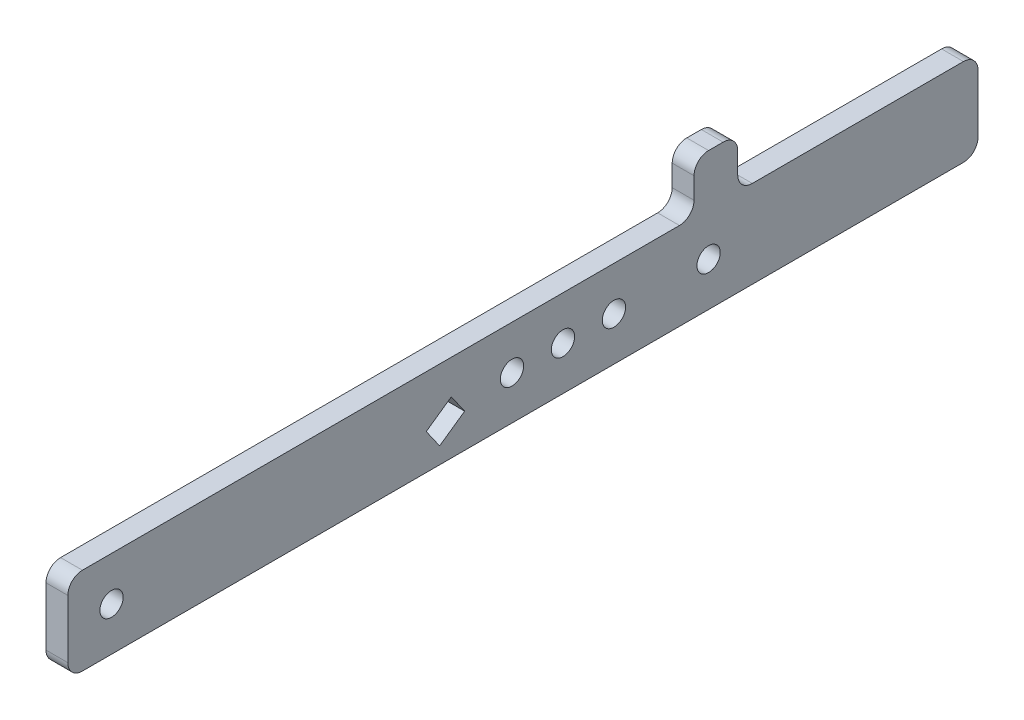
ISO-10303-21;
HEADER;
FILE_DESCRIPTION(('STEP AP214'),'2;1');
FILE_NAME('part.step','',(''),(''),'','','');
FILE_SCHEMA(('AUTOMOTIVE_DESIGN { 1 0 10303 214 1 1 1 1 }'));
ENDSEC;
DATA;
#1=APPLICATION_CONTEXT('core data for automotive mechanical design processes');
#2=APPLICATION_PROTOCOL_DEFINITION('international standard','automotive_design',2000,#1);
#3=PRODUCT_CONTEXT('',#1,'mechanical');
#4=PRODUCT('Part','Part','',(#3));
#5=PRODUCT_RELATED_PRODUCT_CATEGORY('part','',(#4));
#6=PRODUCT_DEFINITION_FORMATION('','',#4);
#7=PRODUCT_DEFINITION_CONTEXT('part definition',#1,'design');
#8=PRODUCT_DEFINITION('design','',#6,#7);
#9=PRODUCT_DEFINITION_SHAPE('','',#8);
#10=(LENGTH_UNIT() NAMED_UNIT(*) SI_UNIT(.MILLI.,.METRE.));
#11=(NAMED_UNIT(*) PLANE_ANGLE_UNIT() SI_UNIT($,.RADIAN.));
#12=(NAMED_UNIT(*) SI_UNIT($,.STERADIAN.) SOLID_ANGLE_UNIT());
#13=UNCERTAINTY_MEASURE_WITH_UNIT(LENGTH_MEASURE(1.E-05),#10,'distance_accuracy_value','');
#14=(GEOMETRIC_REPRESENTATION_CONTEXT(3) GLOBAL_UNCERTAINTY_ASSIGNED_CONTEXT((#13)) GLOBAL_UNIT_ASSIGNED_CONTEXT((#10,
#11,#12)) REPRESENTATION_CONTEXT('',''));
#15=CARTESIAN_POINT('',(0.,0.,0.));
#16=DIRECTION('',(0.,0.,1.));
#17=DIRECTION('',(1.,0.,0.));
#18=AXIS2_PLACEMENT_3D('',#15,#16,#17);
#19=CARTESIAN_POINT('',(-40.,30.0000000000005,-450.));
#20=DIRECTION('',(0.,-1.,0.));
#21=DIRECTION('',(0.,0.,-1.));
#22=AXIS2_PLACEMENT_3D('',#19,#20,#21);
#23=PLANE('',#22);
#24=DIRECTION('',(0.,0.,1.));
#25=VECTOR('',#24,1.);
#26=CARTESIAN_POINT('',(-40.,30.0000000000005,-450.));
#27=LINE('',#26,#25);
#28=CARTESIAN_POINT('',(-40.,30.0000000000005,-245.));
#29=VERTEX_POINT('',#28);
#30=CARTESIAN_POINT('',(-40.,30.0000000000005,165.));
#31=VERTEX_POINT('',#30);
#32=EDGE_CURVE('E260',#29,#31,#27,.T.);
#33=ORIENTED_EDGE('',*,*,#32,.F.);
#34=DIRECTION('',(-1.,0.,0.));
#35=VECTOR('',#34,1.);
#36=CARTESIAN_POINT('',(-40.,30.0000000000005,-245.));
#37=LINE('',#36,#35);
#38=CARTESIAN_POINT('',(-55.,30.0000000000005,-245.));
#39=VERTEX_POINT('',#38);
#40=EDGE_CURVE('E337',#29,#39,#37,.T.);
#41=ORIENTED_EDGE('',*,*,#40,.T.);
#42=DIRECTION('',(0.,0.,1.));
#43=VECTOR('',#42,1.);
#44=CARTESIAN_POINT('',(-55.,30.0000000000005,-450.));
#45=LINE('',#44,#43);
#46=CARTESIAN_POINT('',(-55.,30.0000000000005,165.));
#47=VERTEX_POINT('',#46);
#48=EDGE_CURVE('E265',#39,#47,#45,.T.);
#49=ORIENTED_EDGE('',*,*,#48,.T.);
#50=DIRECTION('',(1.,0.,0.));
#51=VECTOR('',#50,1.);
#52=CARTESIAN_POINT('',(-40.,30.0000000000005,165.));
#53=LINE('',#52,#51);
#54=EDGE_CURVE('E312',#47,#31,#53,.T.);
#55=ORIENTED_EDGE('',*,*,#54,.T.);
#56=EDGE_LOOP('',(#33,#41,#49,#55));
#57=FACE_BOUND('',#56,.T.);
#58=ADVANCED_FACE('F41',(#57),#23,.F.);
#59=CARTESIAN_POINT('',(-55.,0.,-200.));
#60=DIRECTION('',(-1.,0.,0.));
#61=DIRECTION('',(0.,0.,1.));
#62=AXIS2_PLACEMENT_3D('',#59,#60,#61);
#63=CYLINDRICAL_SURFACE('',#62,8.);
#64=CARTESIAN_POINT('',(-39.9999999999997,0.,-200.));
#65=DIRECTION('',(-1.,0.,0.));
#66=DIRECTION('',(0.,0.,1.));
#67=AXIS2_PLACEMENT_3D('',#64,#65,#66);
#68=CIRCLE('',#67,8.);
#69=CARTESIAN_POINT('',(-39.9999999999997,0.,-192.));
#70=VERTEX_POINT('',#69);
#71=EDGE_CURVE('E274',#70,#70,#68,.T.);
#72=ORIENTED_EDGE('',*,*,#71,.F.);
#73=EDGE_LOOP('',(#72));
#74=FACE_BOUND('',#73,.T.);
#75=CARTESIAN_POINT('',(-55.,0.,-200.));
#76=DIRECTION('',(-1.,0.,0.));
#77=DIRECTION('',(0.,0.,1.));
#78=AXIS2_PLACEMENT_3D('',#75,#76,#77);
#79=CIRCLE('',#78,8.);
#80=CARTESIAN_POINT('',(-55.,0.,-192.));
#81=VERTEX_POINT('',#80);
#82=EDGE_CURVE('E277',#81,#81,#79,.T.);
#83=ORIENTED_EDGE('',*,*,#82,.T.);
#84=EDGE_LOOP('',(#83));
#85=FACE_BOUND('',#84,.T.);
#86=ADVANCED_FACE('F472',(#74,#85),#63,.F.);
#87=CARTESIAN_POINT('',(-55.,-30.0000000000005,-450.));
#88=DIRECTION('',(0.,1.,0.));
#89=DIRECTION('',(0.,0.,1.));
#90=AXIS2_PLACEMENT_3D('',#87,#88,#89);
#91=PLANE('',#90);
#92=DIRECTION('',(0.,0.,1.));
#93=VECTOR('',#92,1.);
#94=CARTESIAN_POINT('',(-40.,-30.0000000000005,-450.));
#95=LINE('',#94,#93);
#96=CARTESIAN_POINT('',(-40.,-30.0000000000005,-440.));
#97=VERTEX_POINT('',#96);
#98=CARTESIAN_POINT('',(-40.,-30.0000000000005,165.));
#99=VERTEX_POINT('',#98);
#100=EDGE_CURVE('E250',#97,#99,#95,.T.);
#101=ORIENTED_EDGE('',*,*,#100,.T.);
#102=DIRECTION('',(-1.,0.,0.));
#103=VECTOR('',#102,1.);
#104=CARTESIAN_POINT('',(-55.,-30.0000000000005,165.));
#105=LINE('',#104,#103);
#106=CARTESIAN_POINT('',(-55.,-30.0000000000005,165.));
#107=VERTEX_POINT('',#106);
#108=EDGE_CURVE('E282',#99,#107,#105,.T.);
#109=ORIENTED_EDGE('',*,*,#108,.T.);
#110=DIRECTION('',(0.,0.,1.));
#111=VECTOR('',#110,1.);
#112=CARTESIAN_POINT('',(-55.,-30.0000000000005,-450.));
#113=LINE('',#112,#111);
#114=CARTESIAN_POINT('',(-55.,-30.0000000000005,-440.));
#115=VERTEX_POINT('',#114);
#116=EDGE_CURVE('E270',#115,#107,#113,.T.);
#117=ORIENTED_EDGE('',*,*,#116,.F.);
#118=DIRECTION('',(-1.,0.,0.));
#119=VECTOR('',#118,1.);
#120=CARTESIAN_POINT('',(-55.,-30.0000000000005,-440.));
#121=LINE('',#120,#119);
#122=EDGE_CURVE('E280',#115,#97,#121,.F.);
#123=ORIENTED_EDGE('',*,*,#122,.T.);
#124=EDGE_LOOP('',(#101,#109,#117,#123));
#125=FACE_BOUND('',#124,.T.);
#126=ADVANCED_FACE('F393',(#125),#91,.F.);
#127=CARTESIAN_POINT('',(-55.,-30.0000000000005,-450.));
#128=DIRECTION('',(1.,0.,0.));
#129=DIRECTION('',(0.,0.,-1.));
#130=AXIS2_PLACEMENT_3D('',#127,#128,#129);
#131=PLANE('',#130);
#132=DIRECTION('',(0.,0.573576436351056,-0.819152044288984));
#133=VECTOR('',#132,1.);
#134=CARTESIAN_POINT('',(-55.,-5.61297655954159,-71.1121153167902));
#135=LINE('',#134,#133);
#136=CARTESIAN_POINT('',(-55.,-5.61297655954154,-71.1121153167902));
#137=VERTEX_POINT('',#136);
#138=CARTESIAN_POINT('',(-55.,6.43212860383058,-88.3143082468588));
#139=VERTEX_POINT('',#138);
#140=EDGE_CURVE('E194',#137,#139,#135,.T.);
#141=ORIENTED_EDGE('',*,*,#140,.F.);
#142=DIRECTION('',(0.,0.819152044288984,0.573576436351057));
#143=VECTOR('',#142,1.);
#144=CARTESIAN_POINT('',(-55.,-5.61297655954159,-71.1121153167902));
#145=LINE('',#144,#143);
#146=CARTESIAN_POINT('',(-55.,-18.7194092681653,-80.2893382984071));
#147=VERTEX_POINT('',#146);
#148=EDGE_CURVE('E199',#147,#137,#145,.T.);
#149=ORIENTED_EDGE('',*,*,#148,.F.);
#150=DIRECTION('',(0.,-0.573576436351057,0.819152044288984));
#151=VECTOR('',#150,1.);
#152=CARTESIAN_POINT('',(-55.,-18.7194092681653,-80.2893382984071));
#153=LINE('',#152,#151);
#154=CARTESIAN_POINT('',(-55.,-6.67430410479316,-97.4915312284757));
#155=VERTEX_POINT('',#154);
#156=EDGE_CURVE('E204',#155,#147,#153,.T.);
#157=ORIENTED_EDGE('',*,*,#156,.F.);
#158=DIRECTION('',(0.,-0.819152044288984,-0.573576436351057));
#159=VECTOR('',#158,1.);
#160=CARTESIAN_POINT('',(-55.,6.43212860383058,-88.3143082468588));
#161=LINE('',#160,#159);
#162=EDGE_CURVE('E183',#139,#155,#161,.T.);
#163=ORIENTED_EDGE('',*,*,#162,.F.);
#164=EDGE_LOOP('',(#141,#149,#157,#163));
#165=FACE_BOUND('',#164,.T.);
#166=CARTESIAN_POINT('',(-55.,0.,-165.));
#167=DIRECTION('',(-1.,0.,0.));
#168=DIRECTION('',(0.,0.,1.));
#169=AXIS2_PLACEMENT_3D('',#166,#167,#168);
#170=CIRCLE('',#169,8.);
#171=CARTESIAN_POINT('',(-55.,0.,-157.));
#172=VERTEX_POINT('',#171);
#173=EDGE_CURVE('E219',#172,#172,#170,.T.);
#174=ORIENTED_EDGE('',*,*,#173,.F.);
#175=EDGE_LOOP('',(#174));
#176=FACE_BOUND('',#175,.T.);
#177=CARTESIAN_POINT('',(-55.,0.,-265.));
#178=DIRECTION('',(-1.,0.,0.));
#179=DIRECTION('',(0.,0.,1.));
#180=AXIS2_PLACEMENT_3D('',#177,#178,#179);
#181=CIRCLE('',#180,8.);
#182=CARTESIAN_POINT('',(-55.,0.,-257.));
#183=VERTEX_POINT('',#182);
#184=EDGE_CURVE('E222',#183,#183,#181,.T.);
#185=ORIENTED_EDGE('',*,*,#184,.F.);
#186=EDGE_LOOP('',(#185));
#187=FACE_BOUND('',#186,.T.);
#188=CARTESIAN_POINT('',(-55.,0.,-130.));
#189=DIRECTION('',(-1.,0.,0.));
#190=DIRECTION('',(0.,0.,1.));
#191=AXIS2_PLACEMENT_3D('',#188,#189,#190);
#192=CIRCLE('',#191,8.);
#193=CARTESIAN_POINT('',(-55.,0.,-122.));
#194=VERTEX_POINT('',#193);
#195=EDGE_CURVE('E228',#194,#194,#192,.T.);
#196=ORIENTED_EDGE('',*,*,#195,.F.);
#197=EDGE_LOOP('',(#196));
#198=FACE_BOUND('',#197,.T.);
#199=CARTESIAN_POINT('',(-55.,0.,145.));
#200=DIRECTION('',(-1.,0.,0.));
#201=DIRECTION('',(0.,0.,1.));
#202=AXIS2_PLACEMENT_3D('',#199,#200,#201);
#203=CIRCLE('',#202,8.);
#204=CARTESIAN_POINT('',(-55.,0.,153.));
#205=VERTEX_POINT('',#204);
#206=EDGE_CURVE('E234',#205,#205,#203,.T.);
#207=ORIENTED_EDGE('',*,*,#206,.F.);
#208=EDGE_LOOP('',(#207));
#209=FACE_BOUND('',#208,.T.);
#210=DIRECTION('',(0.,0.,-1.));
#211=VECTOR('',#210,1.);
#212=CARTESIAN_POINT('',(-55.,64.5771722552891,-255.));
#213=LINE('',#212,#211);
#214=CARTESIAN_POINT('',(-55.,64.5771722552891,-265.));
#215=VERTEX_POINT('',#214);
#216=CARTESIAN_POINT('',(-55.,64.5771722552891,-275.));
#217=VERTEX_POINT('',#216);
#218=EDGE_CURVE('E357',#215,#217,#213,.T.);
#219=ORIENTED_EDGE('',*,*,#218,.T.);
#220=CARTESIAN_POINT('',(-55.,54.5771722552891,-275.));
#221=DIRECTION('',(1.,0.,0.));
#222=DIRECTION('',(0.,0.,-1.));
#223=AXIS2_PLACEMENT_3D('',#220,#221,#222);
#224=CIRCLE('',#223,10.);
#225=CARTESIAN_POINT('',(-55.,54.5771722552891,-285.));
#226=VERTEX_POINT('',#225);
#227=EDGE_CURVE('E331',#217,#226,#224,.F.);
#228=ORIENTED_EDGE('',*,*,#227,.T.);
#229=DIRECTION('',(0.,-1.,0.));
#230=VECTOR('',#229,1.);
#231=CARTESIAN_POINT('',(-55.,30.0000000000005,-285.));
#232=LINE('',#231,#230);
#233=CARTESIAN_POINT('',(-55.,40.0000000000005,-285.));
#234=VERTEX_POINT('',#233);
#235=EDGE_CURVE('E427',#226,#234,#232,.T.);
#236=ORIENTED_EDGE('',*,*,#235,.T.);
#237=CARTESIAN_POINT('',(-55.,40.0000000000005,-295.));
#238=DIRECTION('',(1.,0.,0.));
#239=DIRECTION('',(0.,0.,-1.));
#240=AXIS2_PLACEMENT_3D('',#237,#238,#239);
#241=CIRCLE('',#240,10.);
#242=CARTESIAN_POINT('',(-55.,30.0000000000005,-295.));
#243=VERTEX_POINT('',#242);
#244=EDGE_CURVE('E344',#234,#243,#241,.T.);
#245=ORIENTED_EDGE('',*,*,#244,.T.);
#246=CARTESIAN_POINT('',(-55.,30.0000000000005,-440.));
#247=VERTEX_POINT('',#246);
#248=EDGE_CURVE('E266',#247,#243,#45,.T.);
#249=ORIENTED_EDGE('',*,*,#248,.F.);
#250=CARTESIAN_POINT('',(-55.,20.0000000000005,-440.));
#251=DIRECTION('',(1.,0.,0.));
#252=DIRECTION('',(0.,0.,-1.));
#253=AXIS2_PLACEMENT_3D('',#250,#251,#252);
#254=CIRCLE('',#253,10.);
#255=CARTESIAN_POINT('',(-55.,20.0000000000005,-450.));
#256=VERTEX_POINT('',#255);
#257=EDGE_CURVE('E288',#247,#256,#254,.F.);
#258=ORIENTED_EDGE('',*,*,#257,.T.);
#259=DIRECTION('',(0.,1.,0.));
#260=VECTOR('',#259,1.);
#261=CARTESIAN_POINT('',(-55.,-30.0000000000005,-450.));
#262=LINE('',#261,#260);
#263=CARTESIAN_POINT('',(-55.,-20.0000000000005,-450.));
#264=VERTEX_POINT('',#263);
#265=EDGE_CURVE('E241',#264,#256,#262,.T.);
#266=ORIENTED_EDGE('',*,*,#265,.F.);
#267=CARTESIAN_POINT('',(-55.,-20.0000000000005,-440.));
#268=DIRECTION('',(1.,0.,0.));
#269=DIRECTION('',(0.,0.,-1.));
#270=AXIS2_PLACEMENT_3D('',#267,#268,#269);
#271=CIRCLE('',#270,10.);
#272=EDGE_CURVE('E290',#264,#115,#271,.F.);
#273=ORIENTED_EDGE('',*,*,#272,.T.);
#274=ORIENTED_EDGE('',*,*,#116,.T.);
#275=CARTESIAN_POINT('',(-55.,-20.0000000000005,165.));
#276=DIRECTION('',(1.,0.,0.));
#277=DIRECTION('',(0.,0.,-1.));
#278=AXIS2_PLACEMENT_3D('',#275,#276,#277);
#279=CIRCLE('',#278,10.);
#280=CARTESIAN_POINT('',(-55.,-20.0000000000005,175.));
#281=VERTEX_POINT('',#280);
#282=EDGE_CURVE('E292',#107,#281,#279,.F.);
#283=ORIENTED_EDGE('',*,*,#282,.T.);
#284=DIRECTION('',(0.,1.,0.));
#285=VECTOR('',#284,1.);
#286=CARTESIAN_POINT('',(-55.,-30.0000000000005,175.));
#287=LINE('',#286,#285);
#288=CARTESIAN_POINT('',(-55.,20.0000000000005,175.));
#289=VERTEX_POINT('',#288);
#290=EDGE_CURVE('E240',#281,#289,#287,.T.);
#291=ORIENTED_EDGE('',*,*,#290,.T.);
#292=CARTESIAN_POINT('',(-55.,20.0000000000005,165.));
#293=DIRECTION('',(1.,0.,0.));
#294=DIRECTION('',(0.,0.,-1.));
#295=AXIS2_PLACEMENT_3D('',#292,#293,#294);
#296=CIRCLE('',#295,10.);
#297=EDGE_CURVE('E285',#289,#47,#296,.F.);
#298=ORIENTED_EDGE('',*,*,#297,.T.);
#299=ORIENTED_EDGE('',*,*,#48,.F.);
#300=CARTESIAN_POINT('',(-55.,40.0000000000005,-245.));
#301=DIRECTION('',(1.,0.,0.));
#302=DIRECTION('',(0.,0.,-1.));
#303=AXIS2_PLACEMENT_3D('',#300,#301,#302);
#304=CIRCLE('',#303,10.);
#305=CARTESIAN_POINT('',(-55.,40.0000000000005,-255.));
#306=VERTEX_POINT('',#305);
#307=EDGE_CURVE('E49',#39,#306,#304,.T.);
#308=ORIENTED_EDGE('',*,*,#307,.T.);
#309=DIRECTION('',(0.,1.,0.));
#310=VECTOR('',#309,1.);
#311=CARTESIAN_POINT('',(-55.,30.0000000000005,-255.));
#312=LINE('',#311,#310);
#313=CARTESIAN_POINT('',(-55.,54.5771722552891,-255.));
#314=VERTEX_POINT('',#313);
#315=EDGE_CURVE('E352',#306,#314,#312,.T.);
#316=ORIENTED_EDGE('',*,*,#315,.T.);
#317=CARTESIAN_POINT('',(-55.,54.5771722552891,-265.));
#318=DIRECTION('',(1.,0.,0.));
#319=DIRECTION('',(0.,0.,-1.));
#320=AXIS2_PLACEMENT_3D('',#317,#318,#319);
#321=CIRCLE('',#320,10.);
#322=EDGE_CURVE('E329',#314,#215,#321,.F.);
#323=ORIENTED_EDGE('',*,*,#322,.T.);
#324=EDGE_LOOP('',(#219,#228,#236,#245,#249,#258,#266,#273,#274,#283,#291,#298,#299,#308,#316,#323));
#325=FACE_BOUND('',#324,.T.);
#326=ORIENTED_EDGE('',*,*,#82,.F.);
#327=EDGE_LOOP('',(#326));
#328=FACE_BOUND('',#327,.T.);
#329=ADVANCED_FACE('F201',(#165,#176,#187,#198,#209,#325,#328),#131,.F.);
#330=ORIENTED_EDGE('',*,*,#248,.T.);
#331=DIRECTION('',(-1.,0.,0.));
#332=VECTOR('',#331,1.);
#333=CARTESIAN_POINT('',(-40.,30.0000000000005,-295.));
#334=LINE('',#333,#332);
#335=CARTESIAN_POINT('',(-40.,30.0000000000005,-295.));
#336=VERTEX_POINT('',#335);
#337=EDGE_CURVE('E322',#243,#336,#334,.F.);
#338=ORIENTED_EDGE('',*,*,#337,.T.);
#339=CARTESIAN_POINT('',(-40.,30.0000000000005,-440.));
#340=VERTEX_POINT('',#339);
#341=EDGE_CURVE('E261',#340,#336,#27,.T.);
#342=ORIENTED_EDGE('',*,*,#341,.F.);
#343=DIRECTION('',(1.,0.,0.));
#344=VECTOR('',#343,1.);
#345=CARTESIAN_POINT('',(-40.,30.0000000000005,-440.));
#346=LINE('',#345,#344);
#347=EDGE_CURVE('E315',#340,#247,#346,.F.);
#348=ORIENTED_EDGE('',*,*,#347,.T.);
#349=EDGE_LOOP('',(#330,#338,#342,#348));
#350=FACE_BOUND('',#349,.T.);
#351=ADVANCED_FACE('F413',(#350),#23,.F.);
#352=CARTESIAN_POINT('',(-40.,-30.0000000000005,-450.));
#353=DIRECTION('',(-1.,0.,0.));
#354=DIRECTION('',(0.,0.,1.));
#355=AXIS2_PLACEMENT_3D('',#352,#353,#354);
#356=PLANE('',#355);
#357=DIRECTION('',(0.,0.573576436351057,-0.819152044288984));
#358=VECTOR('',#357,1.);
#359=CARTESIAN_POINT('',(-40.,-18.7194092681653,-80.2893382984071));
#360=LINE('',#359,#358);
#361=CARTESIAN_POINT('',(-40.,-18.7194092681653,-80.2893382984071));
#362=VERTEX_POINT('',#361);
#363=CARTESIAN_POINT('',(-40.,-6.67430410479316,-97.4915312284757));
#364=VERTEX_POINT('',#363);
#365=EDGE_CURVE('E437',#362,#364,#360,.T.);
#366=ORIENTED_EDGE('',*,*,#365,.F.);
#367=DIRECTION('',(0.,-0.819152044288984,-0.573576436351057));
#368=VECTOR('',#367,1.);
#369=CARTESIAN_POINT('',(-40.,-5.61297655954159,-71.1121153167902));
#370=LINE('',#369,#368);
#371=CARTESIAN_POINT('',(-40.,-5.61297655954159,-71.1121153167902));
#372=VERTEX_POINT('',#371);
#373=EDGE_CURVE('E216',#372,#362,#370,.T.);
#374=ORIENTED_EDGE('',*,*,#373,.F.);
#375=DIRECTION('',(0.,-0.573576436351057,0.819152044288984));
#376=VECTOR('',#375,1.);
#377=CARTESIAN_POINT('',(-40.,-5.61297655954159,-71.1121153167902));
#378=LINE('',#377,#376);
#379=CARTESIAN_POINT('',(-40.,6.43212860383061,-88.3143082468588));
#380=VERTEX_POINT('',#379);
#381=EDGE_CURVE('E213',#380,#372,#378,.T.);
#382=ORIENTED_EDGE('',*,*,#381,.F.);
#383=DIRECTION('',(0.,0.819152044288984,0.573576436351057));
#384=VECTOR('',#383,1.);
#385=CARTESIAN_POINT('',(-40.,6.43212860383058,-88.3143082468588));
#386=LINE('',#385,#384);
#387=EDGE_CURVE('E186',#364,#380,#386,.T.);
#388=ORIENTED_EDGE('',*,*,#387,.F.);
#389=EDGE_LOOP('',(#366,#374,#382,#388));
#390=FACE_BOUND('',#389,.T.);
#391=CARTESIAN_POINT('',(-39.9999999999997,0.,-165.));
#392=DIRECTION('',(-1.,0.,0.));
#393=DIRECTION('',(0.,0.,1.));
#394=AXIS2_PLACEMENT_3D('',#391,#392,#393);
#395=CIRCLE('',#394,8.);
#396=CARTESIAN_POINT('',(-39.9999999999997,0.,-157.));
#397=VERTEX_POINT('',#396);
#398=EDGE_CURVE('E215',#397,#397,#395,.T.);
#399=ORIENTED_EDGE('',*,*,#398,.T.);
#400=EDGE_LOOP('',(#399));
#401=FACE_BOUND('',#400,.T.);
#402=CARTESIAN_POINT('',(-39.9999999999995,0.,-265.));
#403=DIRECTION('',(-1.,0.,0.));
#404=DIRECTION('',(0.,0.,1.));
#405=AXIS2_PLACEMENT_3D('',#402,#403,#404);
#406=CIRCLE('',#405,8.);
#407=CARTESIAN_POINT('',(-39.9999999999995,0.,-257.));
#408=VERTEX_POINT('',#407);
#409=EDGE_CURVE('E225',#408,#408,#406,.T.);
#410=ORIENTED_EDGE('',*,*,#409,.T.);
#411=EDGE_LOOP('',(#410));
#412=FACE_BOUND('',#411,.T.);
#413=CARTESIAN_POINT('',(-39.9999999999997,0.,-130.));
#414=DIRECTION('',(-1.,0.,0.));
#415=DIRECTION('',(0.,0.,1.));
#416=AXIS2_PLACEMENT_3D('',#413,#414,#415);
#417=CIRCLE('',#416,8.);
#418=CARTESIAN_POINT('',(-39.9999999999997,0.,-122.));
#419=VERTEX_POINT('',#418);
#420=EDGE_CURVE('E231',#419,#419,#417,.T.);
#421=ORIENTED_EDGE('',*,*,#420,.T.);
#422=EDGE_LOOP('',(#421));
#423=FACE_BOUND('',#422,.T.);
#424=CARTESIAN_POINT('',(-39.9999999999998,0.,145.));
#425=DIRECTION('',(-1.,0.,0.));
#426=DIRECTION('',(0.,0.,1.));
#427=AXIS2_PLACEMENT_3D('',#424,#425,#426);
#428=CIRCLE('',#427,8.);
#429=CARTESIAN_POINT('',(-39.9999999999998,0.,153.));
#430=VERTEX_POINT('',#429);
#431=EDGE_CURVE('E237',#430,#430,#428,.T.);
#432=ORIENTED_EDGE('',*,*,#431,.T.);
#433=EDGE_LOOP('',(#432));
#434=FACE_BOUND('',#433,.T.);
#435=DIRECTION('',(0.,1.,0.));
#436=VECTOR('',#435,1.);
#437=CARTESIAN_POINT('',(-40.,30.0000000000005,-285.));
#438=LINE('',#437,#436);
#439=CARTESIAN_POINT('',(-40.,40.0000000000005,-285.));
#440=VERTEX_POINT('',#439);
#441=CARTESIAN_POINT('',(-40.,54.5771722552891,-285.));
#442=VERTEX_POINT('',#441);
#443=EDGE_CURVE('E419',#440,#442,#438,.T.);
#444=ORIENTED_EDGE('',*,*,#443,.T.);
#445=CARTESIAN_POINT('',(-40.,54.5771722552891,-275.));
#446=DIRECTION('',(-1.,0.,0.));
#447=DIRECTION('',(0.,0.,1.));
#448=AXIS2_PLACEMENT_3D('',#445,#446,#447);
#449=CIRCLE('',#448,10.);
#450=CARTESIAN_POINT('',(-40.,64.5771722552891,-275.));
#451=VERTEX_POINT('',#450);
#452=EDGE_CURVE('E335',#442,#451,#449,.F.);
#453=ORIENTED_EDGE('',*,*,#452,.T.);
#454=DIRECTION('',(0.,0.,1.));
#455=VECTOR('',#454,1.);
#456=CARTESIAN_POINT('',(-40.,64.5771722552891,-255.));
#457=LINE('',#456,#455);
#458=CARTESIAN_POINT('',(-40.,64.5771722552891,-265.));
#459=VERTEX_POINT('',#458);
#460=EDGE_CURVE('E429',#451,#459,#457,.T.);
#461=ORIENTED_EDGE('',*,*,#460,.T.);
#462=CARTESIAN_POINT('',(-40.,54.5771722552891,-265.));
#463=DIRECTION('',(-1.,0.,0.));
#464=DIRECTION('',(0.,0.,1.));
#465=AXIS2_PLACEMENT_3D('',#462,#463,#464);
#466=CIRCLE('',#465,10.);
#467=CARTESIAN_POINT('',(-40.,54.5771722552891,-255.));
#468=VERTEX_POINT('',#467);
#469=EDGE_CURVE('E333',#459,#468,#466,.F.);
#470=ORIENTED_EDGE('',*,*,#469,.T.);
#471=DIRECTION('',(0.,-1.,0.));
#472=VECTOR('',#471,1.);
#473=CARTESIAN_POINT('',(-40.,30.0000000000005,-255.));
#474=LINE('',#473,#472);
#475=CARTESIAN_POINT('',(-40.,40.0000000000005,-255.));
#476=VERTEX_POINT('',#475);
#477=EDGE_CURVE('E426',#468,#476,#474,.T.);
#478=ORIENTED_EDGE('',*,*,#477,.T.);
#479=CARTESIAN_POINT('',(-40.,40.0000000000005,-245.));
#480=DIRECTION('',(-1.,0.,0.));
#481=DIRECTION('',(0.,0.,1.));
#482=AXIS2_PLACEMENT_3D('',#479,#480,#481);
#483=CIRCLE('',#482,10.);
#484=EDGE_CURVE('E11',#476,#29,#483,.T.);
#485=ORIENTED_EDGE('',*,*,#484,.T.);
#486=ORIENTED_EDGE('',*,*,#32,.T.);
#487=CARTESIAN_POINT('',(-40.,20.0000000000005,165.));
#488=DIRECTION('',(-1.,0.,0.));
#489=DIRECTION('',(0.,0.,1.));
#490=AXIS2_PLACEMENT_3D('',#487,#488,#489);
#491=CIRCLE('',#490,10.);
#492=CARTESIAN_POINT('',(-40.,20.0000000000005,175.));
#493=VERTEX_POINT('',#492);
#494=EDGE_CURVE('E298',#31,#493,#491,.F.);
#495=ORIENTED_EDGE('',*,*,#494,.T.);
#496=DIRECTION('',(0.,-1.,0.));
#497=VECTOR('',#496,1.);
#498=CARTESIAN_POINT('',(-40.,-30.0000000000005,175.));
#499=LINE('',#498,#497);
#500=CARTESIAN_POINT('',(-40.,-20.0000000000005,175.));
#501=VERTEX_POINT('',#500);
#502=EDGE_CURVE('E246',#493,#501,#499,.T.);
#503=ORIENTED_EDGE('',*,*,#502,.T.);
#504=CARTESIAN_POINT('',(-40.,-20.0000000000005,165.));
#505=DIRECTION('',(-1.,0.,0.));
#506=DIRECTION('',(0.,0.,1.));
#507=AXIS2_PLACEMENT_3D('',#504,#505,#506);
#508=CIRCLE('',#507,10.);
#509=EDGE_CURVE('E304',#501,#99,#508,.F.);
#510=ORIENTED_EDGE('',*,*,#509,.T.);
#511=ORIENTED_EDGE('',*,*,#100,.F.);
#512=CARTESIAN_POINT('',(-40.,-20.0000000000005,-440.));
#513=DIRECTION('',(-1.,0.,0.));
#514=DIRECTION('',(0.,0.,1.));
#515=AXIS2_PLACEMENT_3D('',#512,#513,#514);
#516=CIRCLE('',#515,10.);
#517=CARTESIAN_POINT('',(-40.,-20.0000000000005,-450.));
#518=VERTEX_POINT('',#517);
#519=EDGE_CURVE('E302',#97,#518,#516,.F.);
#520=ORIENTED_EDGE('',*,*,#519,.T.);
#521=DIRECTION('',(0.,-1.,0.));
#522=VECTOR('',#521,1.);
#523=CARTESIAN_POINT('',(-40.,-30.0000000000005,-450.));
#524=LINE('',#523,#522);
#525=CARTESIAN_POINT('',(-40.,20.0000000000005,-450.));
#526=VERTEX_POINT('',#525);
#527=EDGE_CURVE('E245',#526,#518,#524,.T.);
#528=ORIENTED_EDGE('',*,*,#527,.F.);
#529=CARTESIAN_POINT('',(-40.,20.0000000000005,-440.));
#530=DIRECTION('',(-1.,0.,0.));
#531=DIRECTION('',(0.,0.,1.));
#532=AXIS2_PLACEMENT_3D('',#529,#530,#531);
#533=CIRCLE('',#532,10.);
#534=EDGE_CURVE('E300',#526,#340,#533,.F.);
#535=ORIENTED_EDGE('',*,*,#534,.T.);
#536=ORIENTED_EDGE('',*,*,#341,.T.);
#537=CARTESIAN_POINT('',(-40.,40.0000000000005,-295.));
#538=DIRECTION('',(-1.,0.,0.));
#539=DIRECTION('',(0.,0.,1.));
#540=AXIS2_PLACEMENT_3D('',#537,#538,#539);
#541=CIRCLE('',#540,10.);
#542=EDGE_CURVE('E346',#336,#440,#541,.T.);
#543=ORIENTED_EDGE('',*,*,#542,.T.);
#544=EDGE_LOOP('',(#444,#453,#461,#470,#478,#485,#486,#495,#503,#510,#511,#520,#528,#535,#536,#543));
#545=FACE_BOUND('',#544,.T.);
#546=ORIENTED_EDGE('',*,*,#71,.T.);
#547=EDGE_LOOP('',(#546));
#548=FACE_BOUND('',#547,.T.);
#549=ADVANCED_FACE('F376',(#390,#401,#412,#423,#434,#545,#548),#356,.F.);
#550=CARTESIAN_POINT('',(-7.50000000000007,0.,-450.));
#551=DIRECTION('',(0.,0.,1.));
#552=DIRECTION('',(1.,0.,0.));
#553=AXIS2_PLACEMENT_3D('',#550,#551,#552);
#554=PLANE('',#553);
#555=ORIENTED_EDGE('',*,*,#527,.T.);
#556=DIRECTION('',(-1.,0.,0.));
#557=VECTOR('',#556,1.);
#558=CARTESIAN_POINT('',(-7.50000000000007,-20.0000000000005,-450.));
#559=LINE('',#558,#557);
#560=EDGE_CURVE('E309',#518,#264,#559,.T.);
#561=ORIENTED_EDGE('',*,*,#560,.T.);
#562=ORIENTED_EDGE('',*,*,#265,.T.);
#563=DIRECTION('',(1.,0.,0.));
#564=VECTOR('',#563,1.);
#565=CARTESIAN_POINT('',(-7.50000000000007,20.0000000000005,-450.));
#566=LINE('',#565,#564);
#567=EDGE_CURVE('E306',#256,#526,#566,.T.);
#568=ORIENTED_EDGE('',*,*,#567,.T.);
#569=EDGE_LOOP('',(#555,#561,#562,#568));
#570=FACE_BOUND('',#569,.T.);
#571=ADVANCED_FACE('F403',(#570),#554,.F.);
#572=CARTESIAN_POINT('',(-7.5,0.,175.));
#573=DIRECTION('',(0.,0.,1.));
#574=DIRECTION('',(1.,0.,0.));
#575=AXIS2_PLACEMENT_3D('',#572,#573,#574);
#576=PLANE('',#575);
#577=ORIENTED_EDGE('',*,*,#290,.F.);
#578=DIRECTION('',(-1.,0.,0.));
#579=VECTOR('',#578,1.);
#580=CARTESIAN_POINT('',(-40.,-20.0000000000005,175.));
#581=LINE('',#580,#579);
#582=EDGE_CURVE('E296',#281,#501,#581,.F.);
#583=ORIENTED_EDGE('',*,*,#582,.T.);
#584=ORIENTED_EDGE('',*,*,#502,.F.);
#585=DIRECTION('',(1.,0.,0.));
#586=VECTOR('',#585,1.);
#587=CARTESIAN_POINT('',(-55.,20.0000000000005,175.));
#588=LINE('',#587,#586);
#589=EDGE_CURVE('E294',#493,#289,#588,.F.);
#590=ORIENTED_EDGE('',*,*,#589,.T.);
#591=EDGE_LOOP('',(#577,#583,#584,#590));
#592=FACE_BOUND('',#591,.T.);
#593=ADVANCED_FACE('F385',(#592),#576,.T.);
#594=CARTESIAN_POINT('',(-55.,0.,145.));
#595=DIRECTION('',(-1.,0.,0.));
#596=DIRECTION('',(0.,0.,1.));
#597=AXIS2_PLACEMENT_3D('',#594,#595,#596);
#598=CYLINDRICAL_SURFACE('',#597,8.);
#599=ORIENTED_EDGE('',*,*,#431,.F.);
#600=EDGE_LOOP('',(#599));
#601=FACE_BOUND('',#600,.T.);
#602=ORIENTED_EDGE('',*,*,#206,.T.);
#603=EDGE_LOOP('',(#602));
#604=FACE_BOUND('',#603,.T.);
#605=ADVANCED_FACE('F458',(#601,#604),#598,.F.);
#606=CARTESIAN_POINT('',(-55.,0.,-130.));
#607=DIRECTION('',(-1.,0.,0.));
#608=DIRECTION('',(0.,0.,1.));
#609=AXIS2_PLACEMENT_3D('',#606,#607,#608);
#610=CYLINDRICAL_SURFACE('',#609,8.);
#611=ORIENTED_EDGE('',*,*,#420,.F.);
#612=EDGE_LOOP('',(#611));
#613=FACE_BOUND('',#612,.T.);
#614=ORIENTED_EDGE('',*,*,#195,.T.);
#615=EDGE_LOOP('',(#614));
#616=FACE_BOUND('',#615,.T.);
#617=ADVANCED_FACE('F461',(#613,#616),#610,.F.);
#618=CARTESIAN_POINT('',(-55.,0.,-265.));
#619=DIRECTION('',(-1.,0.,0.));
#620=DIRECTION('',(0.,0.,1.));
#621=AXIS2_PLACEMENT_3D('',#618,#619,#620);
#622=CYLINDRICAL_SURFACE('',#621,8.);
#623=ORIENTED_EDGE('',*,*,#409,.F.);
#624=EDGE_LOOP('',(#623));
#625=FACE_BOUND('',#624,.T.);
#626=ORIENTED_EDGE('',*,*,#184,.T.);
#627=EDGE_LOOP('',(#626));
#628=FACE_BOUND('',#627,.T.);
#629=ADVANCED_FACE('F487',(#625,#628),#622,.F.);
#630=CARTESIAN_POINT('',(-55.,0.,-165.));
#631=DIRECTION('',(-1.,0.,0.));
#632=DIRECTION('',(0.,0.,1.));
#633=AXIS2_PLACEMENT_3D('',#630,#631,#632);
#634=CYLINDRICAL_SURFACE('',#633,8.);
#635=ORIENTED_EDGE('',*,*,#398,.F.);
#636=EDGE_LOOP('',(#635));
#637=FACE_BOUND('',#636,.T.);
#638=ORIENTED_EDGE('',*,*,#173,.T.);
#639=EDGE_LOOP('',(#638));
#640=FACE_BOUND('',#639,.T.);
#641=ADVANCED_FACE('F491',(#637,#640),#634,.F.);
#642=CARTESIAN_POINT('',(-55.,-20.0000000000005,165.));
#643=DIRECTION('',(1.,0.,0.));
#644=DIRECTION('',(0.,0.,-1.));
#645=AXIS2_PLACEMENT_3D('',#642,#643,#644);
#646=CYLINDRICAL_SURFACE('',#645,10.);
#647=ORIENTED_EDGE('',*,*,#509,.F.);
#648=ORIENTED_EDGE('',*,*,#582,.F.);
#649=ORIENTED_EDGE('',*,*,#282,.F.);
#650=ORIENTED_EDGE('',*,*,#108,.F.);
#651=EDGE_LOOP('',(#647,#648,#649,#650));
#652=FACE_BOUND('',#651,.T.);
#653=ADVANCED_FACE('F391',(#652),#646,.T.);
#654=CARTESIAN_POINT('',(-7.50000000000007,-20.0000000000005,-440.));
#655=DIRECTION('',(-1.,0.,0.));
#656=DIRECTION('',(0.,0.,1.));
#657=AXIS2_PLACEMENT_3D('',#654,#655,#656);
#658=CYLINDRICAL_SURFACE('',#657,10.);
#659=ORIENTED_EDGE('',*,*,#519,.F.);
#660=ORIENTED_EDGE('',*,*,#122,.F.);
#661=ORIENTED_EDGE('',*,*,#272,.F.);
#662=ORIENTED_EDGE('',*,*,#560,.F.);
#663=EDGE_LOOP('',(#659,#660,#661,#662));
#664=FACE_BOUND('',#663,.T.);
#665=ADVANCED_FACE('F400',(#664),#658,.T.);
#666=CARTESIAN_POINT('',(-7.50000000000007,20.0000000000005,-440.));
#667=DIRECTION('',(1.,0.,0.));
#668=DIRECTION('',(0.,0.,-1.));
#669=AXIS2_PLACEMENT_3D('',#666,#667,#668);
#670=CYLINDRICAL_SURFACE('',#669,10.);
#671=ORIENTED_EDGE('',*,*,#257,.F.);
#672=ORIENTED_EDGE('',*,*,#347,.F.);
#673=ORIENTED_EDGE('',*,*,#534,.F.);
#674=ORIENTED_EDGE('',*,*,#567,.F.);
#675=EDGE_LOOP('',(#671,#672,#673,#674));
#676=FACE_BOUND('',#675,.T.);
#677=ADVANCED_FACE('F409',(#676),#670,.T.);
#678=CARTESIAN_POINT('',(-40.,20.0000000000005,165.));
#679=DIRECTION('',(-1.,0.,0.));
#680=DIRECTION('',(0.,0.,1.));
#681=AXIS2_PLACEMENT_3D('',#678,#679,#680);
#682=CYLINDRICAL_SURFACE('',#681,10.);
#683=ORIENTED_EDGE('',*,*,#297,.F.);
#684=ORIENTED_EDGE('',*,*,#589,.F.);
#685=ORIENTED_EDGE('',*,*,#494,.F.);
#686=ORIENTED_EDGE('',*,*,#54,.F.);
#687=EDGE_LOOP('',(#683,#684,#685,#686));
#688=FACE_BOUND('',#687,.T.);
#689=ADVANCED_FACE('F382',(#688),#682,.T.);
#690=CARTESIAN_POINT('',(-3.55177039734121,-5.61297655954159,-71.1121153167902));
#691=DIRECTION('',(0.,-0.573576436351057,0.819152044288984));
#692=DIRECTION('',(0.,-0.819152044288984,-0.573576436351057));
#693=AXIS2_PLACEMENT_3D('',#690,#691,#692);
#694=PLANE('',#693);
#695=ORIENTED_EDGE('',*,*,#373,.T.);
#696=DIRECTION('',(-1.,0.,0.));
#697=VECTOR('',#696,1.);
#698=CARTESIAN_POINT('',(-3.55177039734121,-18.7194092681653,-80.2893382984071));
#699=LINE('',#698,#697);
#700=EDGE_CURVE('E209',#362,#147,#699,.T.);
#701=ORIENTED_EDGE('',*,*,#700,.T.);
#702=ORIENTED_EDGE('',*,*,#148,.T.);
#703=DIRECTION('',(-1.,0.,0.));
#704=VECTOR('',#703,1.);
#705=CARTESIAN_POINT('',(-3.55177039734121,-5.61297655954159,-71.1121153167902));
#706=LINE('',#705,#704);
#707=EDGE_CURVE('E190',#372,#137,#706,.T.);
#708=ORIENTED_EDGE('',*,*,#707,.F.);
#709=EDGE_LOOP('',(#695,#701,#702,#708));
#710=FACE_BOUND('',#709,.T.);
#711=ADVANCED_FACE('F440',(#710),#694,.F.);
#712=CARTESIAN_POINT('',(-3.55177039734121,-18.7194092681653,-80.2893382984071));
#713=DIRECTION('',(0.,-0.819152044288984,-0.573576436351057));
#714=DIRECTION('',(0.,0.573576436351057,-0.819152044288984));
#715=AXIS2_PLACEMENT_3D('',#712,#713,#714);
#716=PLANE('',#715);
#717=ORIENTED_EDGE('',*,*,#365,.T.);
#718=DIRECTION('',(-1.,0.,0.));
#719=VECTOR('',#718,1.);
#720=CARTESIAN_POINT('',(-3.55177039734122,-6.67430410479316,-97.4915312284757));
#721=LINE('',#720,#719);
#722=EDGE_CURVE('E189',#364,#155,#721,.T.);
#723=ORIENTED_EDGE('',*,*,#722,.T.);
#724=ORIENTED_EDGE('',*,*,#156,.T.);
#725=ORIENTED_EDGE('',*,*,#700,.F.);
#726=EDGE_LOOP('',(#717,#723,#724,#725));
#727=FACE_BOUND('',#726,.T.);
#728=ADVANCED_FACE('F445',(#727),#716,.F.);
#729=CARTESIAN_POINT('',(-3.55177039734122,6.43212860383058,-88.3143082468588));
#730=DIRECTION('',(0.,0.573576436351057,-0.819152044288984));
#731=DIRECTION('',(0.,0.819152044288984,0.573576436351057));
#732=AXIS2_PLACEMENT_3D('',#729,#730,#731);
#733=PLANE('',#732);
#734=ORIENTED_EDGE('',*,*,#387,.T.);
#735=DIRECTION('',(-1.,0.,0.));
#736=VECTOR('',#735,1.);
#737=CARTESIAN_POINT('',(-3.55177039734122,6.43212860383058,-88.3143082468588));
#738=LINE('',#737,#736);
#739=EDGE_CURVE('E178',#380,#139,#738,.T.);
#740=ORIENTED_EDGE('',*,*,#739,.T.);
#741=ORIENTED_EDGE('',*,*,#162,.T.);
#742=ORIENTED_EDGE('',*,*,#722,.F.);
#743=EDGE_LOOP('',(#734,#740,#741,#742));
#744=FACE_BOUND('',#743,.T.);
#745=ADVANCED_FACE('F180',(#744),#733,.F.);
#746=CARTESIAN_POINT('',(-3.55177039734121,-5.61297655954159,-71.1121153167902));
#747=DIRECTION('',(0.,0.819152044288984,0.573576436351057));
#748=DIRECTION('',(0.,-0.573576436351057,0.819152044288984));
#749=AXIS2_PLACEMENT_3D('',#746,#747,#748);
#750=PLANE('',#749);
#751=ORIENTED_EDGE('',*,*,#381,.T.);
#752=ORIENTED_EDGE('',*,*,#707,.T.);
#753=ORIENTED_EDGE('',*,*,#140,.T.);
#754=ORIENTED_EDGE('',*,*,#739,.F.);
#755=EDGE_LOOP('',(#751,#752,#753,#754));
#756=FACE_BOUND('',#755,.T.);
#757=ADVANCED_FACE('F195',(#756),#750,.F.);
#758=CARTESIAN_POINT('',(5.77751458054381,30.0000000000005,-255.));
#759=DIRECTION('',(0.,0.,1.));
#760=DIRECTION('',(1.,0.,0.));
#761=AXIS2_PLACEMENT_3D('',#758,#759,#760);
#762=PLANE('',#761);
#763=ORIENTED_EDGE('',*,*,#315,.F.);
#764=DIRECTION('',(-1.,0.,0.));
#765=VECTOR('',#764,1.);
#766=CARTESIAN_POINT('',(5.77751458054381,40.0000000000005,-255.));
#767=LINE('',#766,#765);
#768=EDGE_CURVE('E62',#306,#476,#767,.F.);
#769=ORIENTED_EDGE('',*,*,#768,.T.);
#770=ORIENTED_EDGE('',*,*,#477,.F.);
#771=DIRECTION('',(-1.,0.,0.));
#772=VECTOR('',#771,1.);
#773=CARTESIAN_POINT('',(5.77751458054381,54.5771722552891,-255.));
#774=LINE('',#773,#772);
#775=EDGE_CURVE('E340',#468,#314,#774,.T.);
#776=ORIENTED_EDGE('',*,*,#775,.T.);
#777=EDGE_LOOP('',(#763,#769,#770,#776));
#778=FACE_BOUND('',#777,.T.);
#779=ADVANCED_FACE('F355',(#778),#762,.T.);
#780=CARTESIAN_POINT('',(5.7775145805438,30.0000000000005,-285.));
#781=DIRECTION('',(0.,0.,-1.));
#782=DIRECTION('',(-1.,0.,0.));
#783=AXIS2_PLACEMENT_3D('',#780,#781,#782);
#784=PLANE('',#783);
#785=ORIENTED_EDGE('',*,*,#443,.F.);
#786=DIRECTION('',(-1.,0.,0.));
#787=VECTOR('',#786,1.);
#788=CARTESIAN_POINT('',(5.7775145805438,40.0000000000005,-285.));
#789=LINE('',#788,#787);
#790=EDGE_CURVE('E319',#440,#234,#789,.T.);
#791=ORIENTED_EDGE('',*,*,#790,.T.);
#792=ORIENTED_EDGE('',*,*,#235,.F.);
#793=DIRECTION('',(-1.,0.,0.));
#794=VECTOR('',#793,1.);
#795=CARTESIAN_POINT('',(5.7775145805438,54.5771722552891,-285.));
#796=LINE('',#795,#794);
#797=EDGE_CURVE('E317',#226,#442,#796,.F.);
#798=ORIENTED_EDGE('',*,*,#797,.T.);
#799=EDGE_LOOP('',(#785,#791,#792,#798));
#800=FACE_BOUND('',#799,.T.);
#801=ADVANCED_FACE('F422',(#800),#784,.T.);
#802=CARTESIAN_POINT('',(5.77751458054381,64.5771722552891,-255.));
#803=DIRECTION('',(0.,1.,0.));
#804=DIRECTION('',(0.,0.,1.));
#805=AXIS2_PLACEMENT_3D('',#802,#803,#804);
#806=PLANE('',#805);
#807=ORIENTED_EDGE('',*,*,#460,.F.);
#808=DIRECTION('',(-1.,0.,0.));
#809=VECTOR('',#808,1.);
#810=CARTESIAN_POINT('',(5.7775145805438,64.5771722552891,-275.));
#811=LINE('',#810,#809);
#812=EDGE_CURVE('E326',#451,#217,#811,.T.);
#813=ORIENTED_EDGE('',*,*,#812,.T.);
#814=ORIENTED_EDGE('',*,*,#218,.F.);
#815=DIRECTION('',(-1.,0.,0.));
#816=VECTOR('',#815,1.);
#817=CARTESIAN_POINT('',(5.7775145805438,64.5771722552891,-265.));
#818=LINE('',#817,#816);
#819=EDGE_CURVE('E324',#215,#459,#818,.F.);
#820=ORIENTED_EDGE('',*,*,#819,.T.);
#821=EDGE_LOOP('',(#807,#813,#814,#820));
#822=FACE_BOUND('',#821,.T.);
#823=ADVANCED_FACE('F506',(#822),#806,.T.);
#824=CARTESIAN_POINT('',(5.7775145805438,40.0000000000005,-295.));
#825=DIRECTION('',(-1.,0.,0.));
#826=DIRECTION('',(0.,0.,1.));
#827=AXIS2_PLACEMENT_3D('',#824,#825,#826);
#828=CYLINDRICAL_SURFACE('',#827,10.);
#829=ORIENTED_EDGE('',*,*,#542,.F.);
#830=ORIENTED_EDGE('',*,*,#337,.F.);
#831=ORIENTED_EDGE('',*,*,#244,.F.);
#832=ORIENTED_EDGE('',*,*,#790,.F.);
#833=EDGE_LOOP('',(#829,#830,#831,#832));
#834=FACE_BOUND('',#833,.T.);
#835=ADVANCED_FACE('F416',(#834),#828,.F.);
#836=CARTESIAN_POINT('',(5.7775145805438,54.5771722552891,-275.));
#837=DIRECTION('',(-1.,0.,0.));
#838=DIRECTION('',(0.,0.,1.));
#839=AXIS2_PLACEMENT_3D('',#836,#837,#838);
#840=CYLINDRICAL_SURFACE('',#839,10.);
#841=ORIENTED_EDGE('',*,*,#452,.F.);
#842=ORIENTED_EDGE('',*,*,#797,.F.);
#843=ORIENTED_EDGE('',*,*,#227,.F.);
#844=ORIENTED_EDGE('',*,*,#812,.F.);
#845=EDGE_LOOP('',(#841,#842,#843,#844));
#846=FACE_BOUND('',#845,.T.);
#847=ADVANCED_FACE('F527',(#846),#840,.T.);
#848=CARTESIAN_POINT('',(-40.,40.0000000000005,-245.));
#849=DIRECTION('',(-1.,0.,0.));
#850=DIRECTION('',(0.,0.,1.));
#851=AXIS2_PLACEMENT_3D('',#848,#849,#850);
#852=CYLINDRICAL_SURFACE('',#851,10.);
#853=ORIENTED_EDGE('',*,*,#484,.F.);
#854=ORIENTED_EDGE('',*,*,#768,.F.);
#855=ORIENTED_EDGE('',*,*,#307,.F.);
#856=ORIENTED_EDGE('',*,*,#40,.F.);
#857=EDGE_LOOP('',(#853,#854,#855,#856));
#858=FACE_BOUND('',#857,.T.);
#859=ADVANCED_FACE('F359',(#858),#852,.F.);
#860=CARTESIAN_POINT('',(5.7775145805438,54.5771722552891,-265.));
#861=DIRECTION('',(-1.,0.,0.));
#862=DIRECTION('',(0.,0.,1.));
#863=AXIS2_PLACEMENT_3D('',#860,#861,#862);
#864=CYLINDRICAL_SURFACE('',#863,10.);
#865=ORIENTED_EDGE('',*,*,#469,.F.);
#866=ORIENTED_EDGE('',*,*,#819,.F.);
#867=ORIENTED_EDGE('',*,*,#322,.F.);
#868=ORIENTED_EDGE('',*,*,#775,.F.);
#869=EDGE_LOOP('',(#865,#866,#867,#868));
#870=FACE_BOUND('',#869,.T.);
#871=ADVANCED_FACE('F43',(#870),#864,.T.);
#872=CLOSED_SHELL('',(#58,#86,#126,#329,#351,#549,#571,#593,#605,#617,#629,#641,#653,#665,#677,
#689,#711,#728,#745,#757,#779,#801,#823,#835,#847,#859,#871));
#873=MANIFOLD_SOLID_BREP('B2',#872);
#874=ADVANCED_BREP_SHAPE_REPRESENTATION('',(#18,#873),#14);
#875=SHAPE_DEFINITION_REPRESENTATION(#9,#874);
ENDSEC;
END-ISO-10303-21;
